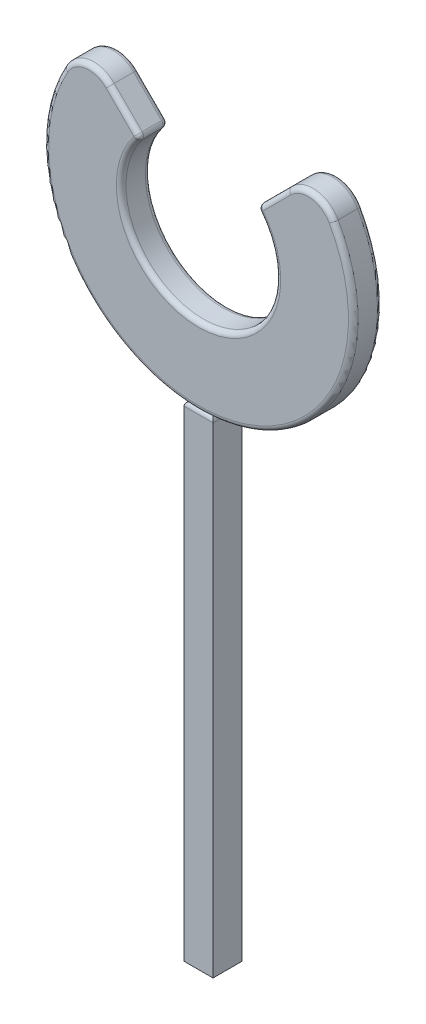
ISO-10303-21;
HEADER;
FILE_DESCRIPTION(('STEP AP214'),'2;1');
FILE_NAME('part.step','',(''),(''),'','','');
FILE_SCHEMA(('AUTOMOTIVE_DESIGN { 1 0 10303 214 1 1 1 1 }'));
ENDSEC;
DATA;
#1=APPLICATION_CONTEXT('core data for automotive mechanical design processes');
#2=APPLICATION_PROTOCOL_DEFINITION('international standard','automotive_design',2000,#1);
#3=PRODUCT_CONTEXT('',#1,'mechanical');
#4=PRODUCT('Part','Part','',(#3));
#5=PRODUCT_RELATED_PRODUCT_CATEGORY('part','',(#4));
#6=PRODUCT_DEFINITION_FORMATION('','',#4);
#7=PRODUCT_DEFINITION_CONTEXT('part definition',#1,'design');
#8=PRODUCT_DEFINITION('design','',#6,#7);
#9=PRODUCT_DEFINITION_SHAPE('','',#8);
#10=(LENGTH_UNIT() NAMED_UNIT(*) SI_UNIT(.MILLI.,.METRE.));
#11=(NAMED_UNIT(*) PLANE_ANGLE_UNIT() SI_UNIT($,.RADIAN.));
#12=(NAMED_UNIT(*) SI_UNIT($,.STERADIAN.) SOLID_ANGLE_UNIT());
#13=UNCERTAINTY_MEASURE_WITH_UNIT(LENGTH_MEASURE(1.E-05),#10,'distance_accuracy_value','');
#14=(GEOMETRIC_REPRESENTATION_CONTEXT(3) GLOBAL_UNCERTAINTY_ASSIGNED_CONTEXT((#13)) GLOBAL_UNIT_ASSIGNED_CONTEXT((#10,
#11,#12)) REPRESENTATION_CONTEXT('',''));
#15=CARTESIAN_POINT('',(0.,0.,0.));
#16=DIRECTION('',(0.,0.,1.));
#17=DIRECTION('',(1.,0.,0.));
#18=AXIS2_PLACEMENT_3D('',#15,#16,#17);
#19=CARTESIAN_POINT('',(-1.5,-15.8,3.));
#20=DIRECTION('',(-1.,0.,0.));
#21=DIRECTION('',(0.,0.,1.));
#22=AXIS2_PLACEMENT_3D('',#19,#20,#21);
#23=PLANE('',#22);
#24=DIRECTION('',(0.,-1.,0.));
#25=VECTOR('',#24,1.);
#26=CARTESIAN_POINT('',(-1.5,-15.8,3.));
#27=LINE('',#26,#25);
#28=CARTESIAN_POINT('',(-1.5,-16.3,3.));
#29=VERTEX_POINT('',#28);
#30=CARTESIAN_POINT('',(-1.5,-66.,3.));
#31=VERTEX_POINT('',#30);
#32=EDGE_CURVE('E131',#29,#31,#27,.T.);
#33=ORIENTED_EDGE('',*,*,#32,.F.);
#34=DIRECTION('',(0.,0.,-1.));
#35=VECTOR('',#34,1.);
#36=CARTESIAN_POINT('',(-1.5,-16.3,0.));
#37=LINE('',#36,#35);
#38=CARTESIAN_POINT('',(-1.5,-16.3,0.));
#39=VERTEX_POINT('',#38);
#40=EDGE_CURVE('E12',#29,#39,#37,.T.);
#41=ORIENTED_EDGE('',*,*,#40,.T.);
#42=DIRECTION('',(0.,-1.,0.));
#43=VECTOR('',#42,1.);
#44=CARTESIAN_POINT('',(-1.5,-15.8,0.));
#45=LINE('',#44,#43);
#46=CARTESIAN_POINT('',(-1.5,-66.,0.));
#47=VERTEX_POINT('',#46);
#48=EDGE_CURVE('E103',#39,#47,#45,.T.);
#49=ORIENTED_EDGE('',*,*,#48,.T.);
#50=DIRECTION('',(0.,0.,-1.));
#51=VECTOR('',#50,1.);
#52=CARTESIAN_POINT('',(-1.5,-66.,3.));
#53=LINE('',#52,#51);
#54=EDGE_CURVE('E106',#31,#47,#53,.T.);
#55=ORIENTED_EDGE('',*,*,#54,.F.);
#56=EDGE_LOOP('',(#33,#41,#49,#55));
#57=FACE_BOUND('',#56,.T.);
#58=ADVANCED_FACE('F49',(#57),#23,.T.);
#59=CARTESIAN_POINT('',(-1.5,-15.8,3.));
#60=DIRECTION('',(0.,0.,1.));
#61=DIRECTION('',(1.,0.,0.));
#62=AXIS2_PLACEMENT_3D('',#59,#60,#61);
#63=PLANE('',#62);
#64=DIRECTION('',(0.,-1.,0.));
#65=VECTOR('',#64,1.);
#66=CARTESIAN_POINT('',(1.5,-15.8,3.));
#67=LINE('',#66,#65);
#68=CARTESIAN_POINT('',(1.5,-16.3,3.));
#69=VERTEX_POINT('',#68);
#70=CARTESIAN_POINT('',(1.5,-66.,3.));
#71=VERTEX_POINT('',#70);
#72=EDGE_CURVE('E134',#69,#71,#67,.T.);
#73=ORIENTED_EDGE('',*,*,#72,.F.);
#74=DIRECTION('',(-1.,0.,0.));
#75=VECTOR('',#74,1.);
#76=CARTESIAN_POINT('',(-1.5,-16.3,3.));
#77=LINE('',#76,#75);
#78=EDGE_CURVE('E58',#69,#29,#77,.T.);
#79=ORIENTED_EDGE('',*,*,#78,.T.);
#80=ORIENTED_EDGE('',*,*,#32,.T.);
#81=DIRECTION('',(-1.,0.,0.));
#82=VECTOR('',#81,1.);
#83=CARTESIAN_POINT('',(-1.5,-66.,3.));
#84=LINE('',#83,#82);
#85=EDGE_CURVE('E112',#71,#31,#84,.T.);
#86=ORIENTED_EDGE('',*,*,#85,.F.);
#87=EDGE_LOOP('',(#73,#79,#80,#86));
#88=FACE_BOUND('',#87,.T.);
#89=ADVANCED_FACE('F169',(#88),#63,.T.);
#90=CARTESIAN_POINT('',(1.5,-15.8,3.));
#91=DIRECTION('',(1.,0.,0.));
#92=DIRECTION('',(0.,0.,-1.));
#93=AXIS2_PLACEMENT_3D('',#90,#91,#92);
#94=PLANE('',#93);
#95=DIRECTION('',(0.,-1.,0.));
#96=VECTOR('',#95,1.);
#97=CARTESIAN_POINT('',(1.5,-15.8,0.));
#98=LINE('',#97,#96);
#99=CARTESIAN_POINT('',(1.5,-16.3,0.));
#100=VERTEX_POINT('',#99);
#101=CARTESIAN_POINT('',(1.5,-66.,0.));
#102=VERTEX_POINT('',#101);
#103=EDGE_CURVE('E111',#100,#102,#98,.T.);
#104=ORIENTED_EDGE('',*,*,#103,.F.);
#105=DIRECTION('',(0.,0.,1.));
#106=VECTOR('',#105,1.);
#107=CARTESIAN_POINT('',(1.5,-16.3,3.));
#108=LINE('',#107,#106);
#109=EDGE_CURVE('E73',#100,#69,#108,.T.);
#110=ORIENTED_EDGE('',*,*,#109,.T.);
#111=ORIENTED_EDGE('',*,*,#72,.T.);
#112=DIRECTION('',(0.,0.,1.));
#113=VECTOR('',#112,1.);
#114=CARTESIAN_POINT('',(1.5,-66.,3.));
#115=LINE('',#114,#113);
#116=EDGE_CURVE('E120',#102,#71,#115,.T.);
#117=ORIENTED_EDGE('',*,*,#116,.F.);
#118=EDGE_LOOP('',(#104,#110,#111,#117));
#119=FACE_BOUND('',#118,.T.);
#120=ADVANCED_FACE('F168',(#119),#94,.T.);
#121=CARTESIAN_POINT('',(-1.5,-15.8,0.));
#122=DIRECTION('',(0.,0.,-1.));
#123=DIRECTION('',(-1.,0.,0.));
#124=AXIS2_PLACEMENT_3D('',#121,#122,#123);
#125=PLANE('',#124);
#126=ORIENTED_EDGE('',*,*,#48,.F.);
#127=DIRECTION('',(1.,0.,0.));
#128=VECTOR('',#127,1.);
#129=CARTESIAN_POINT('',(1.5,-16.3,0.));
#130=LINE('',#129,#128);
#131=EDGE_CURVE('E133',#39,#100,#130,.T.);
#132=ORIENTED_EDGE('',*,*,#131,.T.);
#133=ORIENTED_EDGE('',*,*,#103,.T.);
#134=DIRECTION('',(1.,0.,0.));
#135=VECTOR('',#134,1.);
#136=CARTESIAN_POINT('',(-1.5,-66.,0.));
#137=LINE('',#136,#135);
#138=EDGE_CURVE('E115',#47,#102,#137,.T.);
#139=ORIENTED_EDGE('',*,*,#138,.F.);
#140=EDGE_LOOP('',(#126,#132,#133,#139));
#141=FACE_BOUND('',#140,.T.);
#142=ADVANCED_FACE('F116',(#141),#125,.T.);
#143=CARTESIAN_POINT('',(0.,-15.8,0.));
#144=DIRECTION('',(0.,-1.,0.));
#145=DIRECTION('',(0.,0.,-1.));
#146=AXIS2_PLACEMENT_3D('',#143,#144,#145);
#147=PLANE('',#146);
#148=DIRECTION('',(0.,0.,1.));
#149=VECTOR('',#148,1.);
#150=CARTESIAN_POINT('',(1.,-15.8,0.));
#151=LINE('',#150,#149);
#152=CARTESIAN_POINT('',(0.999999999999999,-15.8,2.5));
#153=VERTEX_POINT('',#152);
#154=CARTESIAN_POINT('',(1.,-15.8,0.5));
#155=VERTEX_POINT('',#154);
#156=EDGE_CURVE('E142',#153,#155,#151,.F.);
#157=ORIENTED_EDGE('',*,*,#156,.T.);
#158=DIRECTION('',(1.,0.,0.));
#159=VECTOR('',#158,1.);
#160=CARTESIAN_POINT('',(-1.5,-15.8,0.499999999999999));
#161=LINE('',#160,#159);
#162=CARTESIAN_POINT('',(-1.,-15.8,0.499999999999999));
#163=VERTEX_POINT('',#162);
#164=EDGE_CURVE('E144',#155,#163,#161,.F.);
#165=ORIENTED_EDGE('',*,*,#164,.T.);
#166=DIRECTION('',(0.,0.,-1.));
#167=VECTOR('',#166,1.);
#168=CARTESIAN_POINT('',(-1.,-15.8,3.));
#169=LINE('',#168,#167);
#170=CARTESIAN_POINT('',(-1.,-15.8,2.5));
#171=VERTEX_POINT('',#170);
#172=EDGE_CURVE('E138',#163,#171,#169,.F.);
#173=ORIENTED_EDGE('',*,*,#172,.T.);
#174=DIRECTION('',(-1.,0.,0.));
#175=VECTOR('',#174,1.);
#176=CARTESIAN_POINT('',(1.5,-15.8,2.5));
#177=LINE('',#176,#175);
#178=EDGE_CURVE('E140',#171,#153,#177,.F.);
#179=ORIENTED_EDGE('',*,*,#178,.T.);
#180=EDGE_LOOP('',(#157,#165,#173,#179));
#181=FACE_BOUND('',#180,.T.);
#182=ADVANCED_FACE('F179',(#181),#147,.F.);
#183=CARTESIAN_POINT('',(0.,-66.,0.));
#184=DIRECTION('',(0.,-1.,0.));
#185=DIRECTION('',(0.,0.,-1.));
#186=AXIS2_PLACEMENT_3D('',#183,#184,#185);
#187=PLANE('',#186);
#188=ORIENTED_EDGE('',*,*,#54,.T.);
#189=ORIENTED_EDGE('',*,*,#138,.T.);
#190=ORIENTED_EDGE('',*,*,#116,.T.);
#191=ORIENTED_EDGE('',*,*,#85,.T.);
#192=EDGE_LOOP('',(#188,#189,#190,#191));
#193=FACE_BOUND('',#192,.T.);
#194=ADVANCED_FACE('F123',(#193),#187,.T.);
#195=CARTESIAN_POINT('',(-1.5,-16.3,2.5));
#196=DIRECTION('',(1.,0.,0.));
#197=DIRECTION('',(0.,0.,-1.));
#198=AXIS2_PLACEMENT_3D('',#195,#196,#197);
#199=CYLINDRICAL_SURFACE('',#198,0.5);
#200=CARTESIAN_POINT('',(0.999999999999999,-16.3,2.5));
#201=DIRECTION('',(0.707106781186548,0.,-0.707106781186547));
#202=DIRECTION('',(0.707106781186547,0.,0.707106781186548));
#203=AXIS2_PLACEMENT_3D('',#200,#201,#202);
#204=ELLIPSE('',#203,0.707106781186547,0.5);
#205=EDGE_CURVE('E127',#153,#69,#204,.T.);
#206=ORIENTED_EDGE('',*,*,#205,.F.);
#207=ORIENTED_EDGE('',*,*,#178,.F.);
#208=CARTESIAN_POINT('',(-1.,-16.3,2.5));
#209=DIRECTION('',(0.707106781186548,0.,0.707106781186547));
#210=DIRECTION('',(-0.707106781186548,0.,0.707106781186548));
#211=AXIS2_PLACEMENT_3D('',#208,#209,#210);
#212=ELLIPSE('',#211,0.707106781186547,0.5);
#213=EDGE_CURVE('E53',#29,#171,#212,.F.);
#214=ORIENTED_EDGE('',*,*,#213,.F.);
#215=ORIENTED_EDGE('',*,*,#78,.F.);
#216=EDGE_LOOP('',(#206,#207,#214,#215));
#217=FACE_BOUND('',#216,.T.);
#218=ADVANCED_FACE('F51',(#217),#199,.T.);
#219=CARTESIAN_POINT('',(-1.,-16.3,3.));
#220=DIRECTION('',(0.,0.,1.));
#221=DIRECTION('',(1.,0.,0.));
#222=AXIS2_PLACEMENT_3D('',#219,#220,#221);
#223=CYLINDRICAL_SURFACE('',#222,0.5);
#224=ORIENTED_EDGE('',*,*,#213,.T.);
#225=ORIENTED_EDGE('',*,*,#172,.F.);
#226=CARTESIAN_POINT('',(-1.,-16.3,0.499999999999999));
#227=DIRECTION('',(-0.707106781186548,0.,0.707106781186548));
#228=DIRECTION('',(0.707106781186548,0.,0.707106781186547));
#229=AXIS2_PLACEMENT_3D('',#226,#227,#228);
#230=ELLIPSE('',#229,0.707106781186548,0.5);
#231=EDGE_CURVE('E151',#39,#163,#230,.F.);
#232=ORIENTED_EDGE('',*,*,#231,.F.);
#233=ORIENTED_EDGE('',*,*,#40,.F.);
#234=EDGE_LOOP('',(#224,#225,#232,#233));
#235=FACE_BOUND('',#234,.T.);
#236=ADVANCED_FACE('F163',(#235),#223,.T.);
#237=CARTESIAN_POINT('',(0.999999999999999,-16.3,3.));
#238=DIRECTION('',(0.,0.,-1.));
#239=DIRECTION('',(-1.,0.,0.));
#240=AXIS2_PLACEMENT_3D('',#237,#238,#239);
#241=CYLINDRICAL_SURFACE('',#240,0.5);
#242=ORIENTED_EDGE('',*,*,#205,.T.);
#243=ORIENTED_EDGE('',*,*,#109,.F.);
#244=CARTESIAN_POINT('',(1.,-16.3,0.5));
#245=DIRECTION('',(-0.707106781186547,0.,-0.707106781186548));
#246=DIRECTION('',(0.707106781186548,0.,-0.707106781186547));
#247=AXIS2_PLACEMENT_3D('',#244,#245,#246);
#248=ELLIPSE('',#247,0.707106781186548,0.5);
#249=EDGE_CURVE('E149',#155,#100,#248,.T.);
#250=ORIENTED_EDGE('',*,*,#249,.F.);
#251=ORIENTED_EDGE('',*,*,#156,.F.);
#252=EDGE_LOOP('',(#242,#243,#250,#251));
#253=FACE_BOUND('',#252,.T.);
#254=ADVANCED_FACE('F156',(#253),#241,.T.);
#255=CARTESIAN_POINT('',(-1.5,-16.3,0.499999999999999));
#256=DIRECTION('',(-1.,0.,0.));
#257=DIRECTION('',(0.,0.,1.));
#258=AXIS2_PLACEMENT_3D('',#255,#256,#257);
#259=CYLINDRICAL_SURFACE('',#258,0.5);
#260=ORIENTED_EDGE('',*,*,#231,.T.);
#261=ORIENTED_EDGE('',*,*,#164,.F.);
#262=ORIENTED_EDGE('',*,*,#249,.T.);
#263=ORIENTED_EDGE('',*,*,#131,.F.);
#264=EDGE_LOOP('',(#260,#261,#262,#263));
#265=FACE_BOUND('',#264,.T.);
#266=ADVANCED_FACE('F167',(#265),#259,.T.);
#267=CLOSED_SHELL('',(#58,#89,#120,#142,#182,#194,#218,#236,#254,#266));
#268=MANIFOLD_SOLID_BREP('B2',#267);
#269=CARTESIAN_POINT('',(0.,0.,3.));
#270=DIRECTION('',(0.,0.,1.));
#271=DIRECTION('',(1.,0.,0.));
#272=AXIS2_PLACEMENT_3D('',#269,#270,#271);
#273=PLANE('',#272);
#274=DIRECTION('',(0.707106781186546,0.707106781186549,0.));
#275=VECTOR('',#274,1.);
#276=CARTESIAN_POINT('',(6.35355339059327,4.93794923153591,3.));
#277=LINE('',#276,#275);
#278=CARTESIAN_POINT('',(9.56057328211555,8.1449691230582,3.));
#279=VERTEX_POINT('',#278);
#280=CARTESIAN_POINT('',(6.67638785977972,5.26078370072235,3.));
#281=VERTEX_POINT('',#280);
#282=EDGE_CURVE('E393',#279,#281,#277,.F.);
#283=ORIENTED_EDGE('',*,*,#282,.T.);
#284=CARTESIAN_POINT('',(0.,0.,3.));
#285=DIRECTION('',(0.,0.,1.));
#286=DIRECTION('',(1.,0.,0.));
#287=AXIS2_PLACEMENT_3D('',#284,#285,#286);
#288=CIRCLE('',#287,8.5);
#289=CARTESIAN_POINT('',(-6.67638785977972,5.26078370072235,3.));
#290=VERTEX_POINT('',#289);
#291=EDGE_CURVE('E503',#281,#290,#288,.F.);
#292=ORIENTED_EDGE('',*,*,#291,.T.);
#293=DIRECTION('',(0.707106781186546,-0.707106781186549,0.));
#294=VECTOR('',#293,1.);
#295=CARTESIAN_POINT('',(-9.56057328211556,8.14496912305821,3.));
#296=LINE('',#295,#294);
#297=CARTESIAN_POINT('',(-9.56057328211555,8.1449691230582,3.));
#298=VERTEX_POINT('',#297);
#299=EDGE_CURVE('E489',#290,#298,#296,.F.);
#300=ORIENTED_EDGE('',*,*,#299,.T.);
#301=CARTESIAN_POINT('',(-11.3283402350819,6.37720217009184,3.));
#302=DIRECTION('',(0.,0.,1.));
#303=DIRECTION('',(1.,0.,0.));
#304=AXIS2_PLACEMENT_3D('',#301,#302,#303);
#305=CIRCLE('',#304,2.5);
#306=CARTESIAN_POINT('',(-13.5068672033669,7.6035872028018,3.));
#307=VERTEX_POINT('',#306);
#308=EDGE_CURVE('E492',#298,#307,#305,.T.);
#309=ORIENTED_EDGE('',*,*,#308,.T.);
#310=CARTESIAN_POINT('',(0.,0.,3.));
#311=DIRECTION('',(0.,0.,1.));
#312=DIRECTION('',(1.,0.,0.));
#313=AXIS2_PLACEMENT_3D('',#310,#311,#312);
#314=CIRCLE('',#313,15.5);
#315=CARTESIAN_POINT('',(13.5068672033669,7.6035872028018,3.));
#316=VERTEX_POINT('',#315);
#317=EDGE_CURVE('E495',#307,#316,#314,.T.);
#318=ORIENTED_EDGE('',*,*,#317,.T.);
#319=CARTESIAN_POINT('',(11.3283402350819,6.37720217009184,3.));
#320=DIRECTION('',(0.,0.,1.));
#321=DIRECTION('',(1.,0.,0.));
#322=AXIS2_PLACEMENT_3D('',#319,#320,#321);
#323=CIRCLE('',#322,2.5);
#324=EDGE_CURVE('E498',#316,#279,#323,.T.);
#325=ORIENTED_EDGE('',*,*,#324,.T.);
#326=EDGE_LOOP('',(#283,#292,#300,#309,#318,#325));
#327=FACE_BOUND('',#326,.T.);
#328=ADVANCED_FACE('F253',(#327),#273,.T.);
#329=CARTESIAN_POINT('',(0.,0.,0.));
#330=DIRECTION('',(0.,0.,1.));
#331=DIRECTION('',(1.,0.,0.));
#332=AXIS2_PLACEMENT_3D('',#329,#330,#331);
#333=PLANE('',#332);
#334=DIRECTION('',(0.707106781186546,0.707106781186549,0.));
#335=VECTOR('',#334,1.);
#336=CARTESIAN_POINT('',(0.707802079528696,-0.707802079528693,0.));
#337=LINE('',#336,#335);
#338=CARTESIAN_POINT('',(6.67638785977972,5.26078370072235,0.));
#339=VERTEX_POINT('',#338);
#340=CARTESIAN_POINT('',(9.56057328211555,8.1449691230582,0.));
#341=VERTEX_POINT('',#340);
#342=EDGE_CURVE('E263',#339,#341,#337,.T.);
#343=ORIENTED_EDGE('',*,*,#342,.T.);
#344=CARTESIAN_POINT('',(11.3283402350819,6.37720217009184,0.));
#345=DIRECTION('',(0.,0.,1.));
#346=DIRECTION('',(1.,0.,0.));
#347=AXIS2_PLACEMENT_3D('',#344,#345,#346);
#348=CIRCLE('',#347,2.5);
#349=CARTESIAN_POINT('',(13.5068672033669,7.6035872028018,0.));
#350=VERTEX_POINT('',#349);
#351=EDGE_CURVE('E47',#341,#350,#348,.F.);
#352=ORIENTED_EDGE('',*,*,#351,.T.);
#353=CARTESIAN_POINT('',(0.,0.,0.));
#354=DIRECTION('',(0.,0.,1.));
#355=DIRECTION('',(1.,0.,0.));
#356=AXIS2_PLACEMENT_3D('',#353,#354,#355);
#357=CIRCLE('',#356,15.5);
#358=CARTESIAN_POINT('',(-13.5068672033669,7.6035872028018,0.));
#359=VERTEX_POINT('',#358);
#360=EDGE_CURVE('E520',#350,#359,#357,.F.);
#361=ORIENTED_EDGE('',*,*,#360,.T.);
#362=CARTESIAN_POINT('',(-11.3283402350819,6.37720217009184,0.));
#363=DIRECTION('',(0.,0.,1.));
#364=DIRECTION('',(1.,0.,0.));
#365=AXIS2_PLACEMENT_3D('',#362,#363,#364);
#366=CIRCLE('',#365,2.5);
#367=CARTESIAN_POINT('',(-9.56057328211555,8.1449691230582,0.));
#368=VERTEX_POINT('',#367);
#369=EDGE_CURVE('E523',#359,#368,#366,.F.);
#370=ORIENTED_EDGE('',*,*,#369,.T.);
#371=DIRECTION('',(0.707106781186546,-0.707106781186549,0.));
#372=VECTOR('',#371,1.);
#373=CARTESIAN_POINT('',(-0.707802079528696,-0.707802079528693,0.));
#374=LINE('',#373,#372);
#375=CARTESIAN_POINT('',(-6.67638785977972,5.26078370072235,0.));
#376=VERTEX_POINT('',#375);
#377=EDGE_CURVE('E526',#368,#376,#374,.T.);
#378=ORIENTED_EDGE('',*,*,#377,.T.);
#379=CARTESIAN_POINT('',(0.,0.,0.));
#380=DIRECTION('',(0.,0.,1.));
#381=DIRECTION('',(1.,0.,0.));
#382=AXIS2_PLACEMENT_3D('',#379,#380,#381);
#383=CIRCLE('',#382,8.5);
#384=EDGE_CURVE('E274',#376,#339,#383,.T.);
#385=ORIENTED_EDGE('',*,*,#384,.T.);
#386=EDGE_LOOP('',(#343,#352,#361,#370,#378,#385));
#387=FACE_BOUND('',#386,.T.);
#388=ADVANCED_FACE('F627',(#387),#333,.F.);
#389=CARTESIAN_POINT('',(0.,0.,3.));
#390=DIRECTION('',(0.,0.,-1.));
#391=DIRECTION('',(-1.,0.,0.));
#392=AXIS2_PLACEMENT_3D('',#389,#390,#391);
#393=CYLINDRICAL_SURFACE('',#392,16.);
#394=DIRECTION('',(0.,0.,-1.));
#395=VECTOR('',#394,1.);
#396=CARTESIAN_POINT('',(13.9425725970239,7.8488642093438,3.));
#397=LINE('',#396,#395);
#398=CARTESIAN_POINT('',(13.9425725970239,7.8488642093438,0.5));
#399=VERTEX_POINT('',#398);
#400=CARTESIAN_POINT('',(13.9425725970239,7.8488642093438,2.5));
#401=VERTEX_POINT('',#400);
#402=EDGE_CURVE('E447',#399,#401,#397,.F.);
#403=ORIENTED_EDGE('',*,*,#402,.T.);
#404=CARTESIAN_POINT('',(0.,0.,2.5));
#405=DIRECTION('',(0.,0.,1.));
#406=DIRECTION('',(1.,0.,0.));
#407=AXIS2_PLACEMENT_3D('',#404,#405,#406);
#408=CIRCLE('',#407,16.);
#409=CARTESIAN_POINT('',(-13.9425725970239,7.8488642093438,2.5));
#410=VERTEX_POINT('',#409);
#411=EDGE_CURVE('E511',#401,#410,#408,.F.);
#412=ORIENTED_EDGE('',*,*,#411,.T.);
#413=DIRECTION('',(0.,0.,-1.));
#414=VECTOR('',#413,1.);
#415=CARTESIAN_POINT('',(-13.9425725970239,7.8488642093438,3.));
#416=LINE('',#415,#414);
#417=CARTESIAN_POINT('',(-13.9425725970239,7.8488642093438,0.5));
#418=VERTEX_POINT('',#417);
#419=EDGE_CURVE('E453',#410,#418,#416,.T.);
#420=ORIENTED_EDGE('',*,*,#419,.T.);
#421=CARTESIAN_POINT('',(0.,0.,0.5));
#422=DIRECTION('',(0.,0.,1.));
#423=DIRECTION('',(1.,0.,0.));
#424=AXIS2_PLACEMENT_3D('',#421,#422,#423);
#425=CIRCLE('',#424,16.);
#426=EDGE_CURVE('E390',#418,#399,#425,.T.);
#427=ORIENTED_EDGE('',*,*,#426,.T.);
#428=EDGE_LOOP('',(#403,#412,#420,#427));
#429=FACE_BOUND('',#428,.T.);
#430=ADVANCED_FACE('F584',(#429),#393,.T.);
#431=CARTESIAN_POINT('',(0.,0.,3.));
#432=DIRECTION('',(0.,0.,-1.));
#433=DIRECTION('',(-1.,0.,0.));
#434=AXIS2_PLACEMENT_3D('',#431,#432,#433);
#435=CYLINDRICAL_SURFACE('',#434,8.);
#436=DIRECTION('',(0.,0.,-1.));
#437=VECTOR('',#436,1.);
#438=CARTESIAN_POINT('',(-6.28365916214562,4.95132583597398,3.));
#439=LINE('',#438,#437);
#440=CARTESIAN_POINT('',(-6.28365916214562,4.95132583597398,0.5));
#441=VERTEX_POINT('',#440);
#442=CARTESIAN_POINT('',(-6.28365916214562,4.95132583597398,2.5));
#443=VERTEX_POINT('',#442);
#444=EDGE_CURVE('E470',#441,#443,#439,.F.);
#445=ORIENTED_EDGE('',*,*,#444,.T.);
#446=CARTESIAN_POINT('',(0.,0.,2.5));
#447=DIRECTION('',(0.,0.,1.));
#448=DIRECTION('',(1.,0.,0.));
#449=AXIS2_PLACEMENT_3D('',#446,#447,#448);
#450=CIRCLE('',#449,8.);
#451=CARTESIAN_POINT('',(6.28365916214562,4.95132583597398,2.5));
#452=VERTEX_POINT('',#451);
#453=EDGE_CURVE('E477',#443,#452,#450,.T.);
#454=ORIENTED_EDGE('',*,*,#453,.T.);
#455=DIRECTION('',(0.,0.,-1.));
#456=VECTOR('',#455,1.);
#457=CARTESIAN_POINT('',(6.28365916214562,4.95132583597398,3.));
#458=LINE('',#457,#456);
#459=CARTESIAN_POINT('',(6.28365916214562,4.95132583597398,0.5));
#460=VERTEX_POINT('',#459);
#461=EDGE_CURVE('E473',#452,#460,#458,.T.);
#462=ORIENTED_EDGE('',*,*,#461,.T.);
#463=CARTESIAN_POINT('',(0.,0.,0.5));
#464=DIRECTION('',(0.,0.,1.));
#465=DIRECTION('',(1.,0.,0.));
#466=AXIS2_PLACEMENT_3D('',#463,#464,#465);
#467=CIRCLE('',#466,8.);
#468=EDGE_CURVE('E366',#460,#441,#467,.F.);
#469=ORIENTED_EDGE('',*,*,#468,.T.);
#470=EDGE_LOOP('',(#445,#454,#462,#469));
#471=FACE_BOUND('',#470,.T.);
#472=ADVANCED_FACE('F564',(#471),#435,.F.);
#473=CARTESIAN_POINT('',(6.,5.29150262212918,0.));
#474=DIRECTION('',(0.707106781186549,-0.707106781186546,0.));
#475=DIRECTION('',(0.707106781186546,0.707106781186549,0.));
#476=AXIS2_PLACEMENT_3D('',#473,#474,#475);
#477=PLANE('',#476);
#478=DIRECTION('',(0.,0.,1.));
#479=VECTOR('',#478,1.);
#480=CARTESIAN_POINT('',(6.32283446918644,5.61433709131563,3.));
#481=LINE('',#480,#479);
#482=CARTESIAN_POINT('',(6.32283446918644,5.61433709131563,0.5));
#483=VERTEX_POINT('',#482);
#484=CARTESIAN_POINT('',(6.32283446918644,5.61433709131563,2.5));
#485=VERTEX_POINT('',#484);
#486=EDGE_CURVE('E361',#483,#485,#481,.T.);
#487=ORIENTED_EDGE('',*,*,#486,.T.);
#488=DIRECTION('',(0.707106781186546,0.707106781186549,0.));
#489=VECTOR('',#488,1.);
#490=CARTESIAN_POINT('',(9.20701989152228,8.49852251365147,2.5));
#491=LINE('',#490,#489);
#492=CARTESIAN_POINT('',(9.20701989152228,8.49852251365147,2.5));
#493=VERTEX_POINT('',#492);
#494=EDGE_CURVE('E355',#485,#493,#491,.T.);
#495=ORIENTED_EDGE('',*,*,#494,.T.);
#496=DIRECTION('',(0.,0.,-1.));
#497=VECTOR('',#496,1.);
#498=CARTESIAN_POINT('',(9.20701989152228,8.49852251365147,0.));
#499=LINE('',#498,#497);
#500=CARTESIAN_POINT('',(9.20701989152228,8.49852251365147,0.5));
#501=VERTEX_POINT('',#500);
#502=EDGE_CURVE('E358',#493,#501,#499,.T.);
#503=ORIENTED_EDGE('',*,*,#502,.T.);
#504=DIRECTION('',(0.707106781186546,0.707106781186549,0.));
#505=VECTOR('',#504,1.);
#506=CARTESIAN_POINT('',(6.,5.29150262212918,0.5));
#507=LINE('',#506,#505);
#508=EDGE_CURVE('E377',#501,#483,#507,.F.);
#509=ORIENTED_EDGE('',*,*,#508,.T.);
#510=EDGE_LOOP('',(#487,#495,#503,#509));
#511=FACE_BOUND('',#510,.T.);
#512=ADVANCED_FACE('F357',(#511),#477,.F.);
#513=CARTESIAN_POINT('',(-18.,17.2915026221292,0.));
#514=DIRECTION('',(-0.707106781186549,-0.707106781186546,0.));
#515=DIRECTION('',(0.707106781186546,-0.707106781186549,0.));
#516=AXIS2_PLACEMENT_3D('',#513,#514,#515);
#517=PLANE('',#516);
#518=DIRECTION('',(0.,0.,-1.));
#519=VECTOR('',#518,1.);
#520=CARTESIAN_POINT('',(-9.20701989152228,8.49852251365147,0.));
#521=LINE('',#520,#519);
#522=CARTESIAN_POINT('',(-9.20701989152228,8.49852251365147,0.5));
#523=VERTEX_POINT('',#522);
#524=CARTESIAN_POINT('',(-9.20701989152228,8.49852251365147,2.5));
#525=VERTEX_POINT('',#524);
#526=EDGE_CURVE('E378',#523,#525,#521,.F.);
#527=ORIENTED_EDGE('',*,*,#526,.T.);
#528=DIRECTION('',(0.707106781186546,-0.707106781186549,0.));
#529=VECTOR('',#528,1.);
#530=CARTESIAN_POINT('',(-6.,5.29150262212918,2.5));
#531=LINE('',#530,#529);
#532=CARTESIAN_POINT('',(-6.32283446918645,5.61433709131563,2.5));
#533=VERTEX_POINT('',#532);
#534=EDGE_CURVE('E486',#525,#533,#531,.T.);
#535=ORIENTED_EDGE('',*,*,#534,.T.);
#536=DIRECTION('',(0.,0.,1.));
#537=VECTOR('',#536,1.);
#538=CARTESIAN_POINT('',(-6.32283446918644,5.61433709131563,0.));
#539=LINE('',#538,#537);
#540=CARTESIAN_POINT('',(-6.32283446918645,5.61433709131563,0.5));
#541=VERTEX_POINT('',#540);
#542=EDGE_CURVE('E483',#533,#541,#539,.F.);
#543=ORIENTED_EDGE('',*,*,#542,.T.);
#544=DIRECTION('',(0.707106781186546,-0.707106781186549,0.));
#545=VECTOR('',#544,1.);
#546=CARTESIAN_POINT('',(-18.,17.2915026221292,0.5));
#547=LINE('',#546,#545);
#548=EDGE_CURVE('E480',#541,#523,#547,.F.);
#549=ORIENTED_EDGE('',*,*,#548,.T.);
#550=EDGE_LOOP('',(#527,#535,#543,#549));
#551=FACE_BOUND('',#550,.T.);
#552=ADVANCED_FACE('F599',(#551),#517,.F.);
#553=CARTESIAN_POINT('',(-11.3283402350819,6.37720217009184,3.));
#554=DIRECTION('',(0.,0.,-1.));
#555=DIRECTION('',(-1.,0.,0.));
#556=AXIS2_PLACEMENT_3D('',#553,#554,#555);
#557=CYLINDRICAL_SURFACE('',#556,3.);
#558=ORIENTED_EDGE('',*,*,#419,.F.);
#559=CARTESIAN_POINT('',(-11.3283402350819,6.37720217009184,2.5));
#560=DIRECTION('',(0.,0.,1.));
#561=DIRECTION('',(1.,0.,0.));
#562=AXIS2_PLACEMENT_3D('',#559,#560,#561);
#563=CIRCLE('',#562,3.);
#564=EDGE_CURVE('E517',#410,#525,#563,.F.);
#565=ORIENTED_EDGE('',*,*,#564,.T.);
#566=ORIENTED_EDGE('',*,*,#526,.F.);
#567=CARTESIAN_POINT('',(-11.3283402350819,6.37720217009184,0.5));
#568=DIRECTION('',(0.,0.,1.));
#569=DIRECTION('',(1.,0.,0.));
#570=AXIS2_PLACEMENT_3D('',#567,#568,#569);
#571=CIRCLE('',#570,3.);
#572=EDGE_CURVE('E514',#523,#418,#571,.T.);
#573=ORIENTED_EDGE('',*,*,#572,.T.);
#574=EDGE_LOOP('',(#558,#565,#566,#573));
#575=FACE_BOUND('',#574,.T.);
#576=ADVANCED_FACE('F587',(#575),#557,.T.);
#577=CARTESIAN_POINT('',(11.3283402350819,6.37720217009184,3.));
#578=DIRECTION('',(0.,0.,-1.));
#579=DIRECTION('',(-1.,0.,0.));
#580=AXIS2_PLACEMENT_3D('',#577,#578,#579);
#581=CYLINDRICAL_SURFACE('',#580,3.);
#582=ORIENTED_EDGE('',*,*,#502,.F.);
#583=CARTESIAN_POINT('',(11.3283402350819,6.37720217009184,2.5));
#584=DIRECTION('',(0.,0.,1.));
#585=DIRECTION('',(1.,0.,0.));
#586=AXIS2_PLACEMENT_3D('',#583,#584,#585);
#587=CIRCLE('',#586,3.);
#588=EDGE_CURVE('E372',#493,#401,#587,.F.);
#589=ORIENTED_EDGE('',*,*,#588,.T.);
#590=ORIENTED_EDGE('',*,*,#402,.F.);
#591=CARTESIAN_POINT('',(11.3283402350819,6.37720217009184,0.5));
#592=DIRECTION('',(0.,0.,1.));
#593=DIRECTION('',(1.,0.,0.));
#594=AXIS2_PLACEMENT_3D('',#591,#592,#593);
#595=CIRCLE('',#594,3.);
#596=EDGE_CURVE('E375',#399,#501,#595,.T.);
#597=ORIENTED_EDGE('',*,*,#596,.T.);
#598=EDGE_LOOP('',(#582,#589,#590,#597));
#599=FACE_BOUND('',#598,.T.);
#600=ADVANCED_FACE('F370',(#599),#581,.T.);
#601=CARTESIAN_POINT('',(-11.3283402350819,6.37720217009184,0.5));
#602=DIRECTION('',(0.,0.,1.));
#603=DIRECTION('',(1.,0.,0.));
#604=AXIS2_PLACEMENT_3D('',#601,#602,#603);
#605=TOROIDAL_SURFACE('',#604,2.5,0.5);
#606=CARTESIAN_POINT('',(-13.5068672033669,7.6035872028018,0.5));
#607=DIRECTION('',(-0.490554013083987,-0.871410787313994,0.));
#608=DIRECTION('',(0.871410787313994,-0.490554013083987,0.));
#609=AXIS2_PLACEMENT_3D('',#606,#607,#608);
#610=CIRCLE('',#609,0.5);
#611=EDGE_CURVE('E438',#418,#359,#610,.T.);
#612=ORIENTED_EDGE('',*,*,#611,.F.);
#613=ORIENTED_EDGE('',*,*,#572,.F.);
#614=CARTESIAN_POINT('',(-9.56057328211555,8.1449691230582,0.5));
#615=DIRECTION('',(0.707106781186546,-0.707106781186549,0.));
#616=DIRECTION('',(0.707106781186549,0.707106781186546,0.));
#617=AXIS2_PLACEMENT_3D('',#614,#615,#616);
#618=CIRCLE('',#617,0.5);
#619=EDGE_CURVE('E257',#368,#523,#618,.T.);
#620=ORIENTED_EDGE('',*,*,#619,.F.);
#621=ORIENTED_EDGE('',*,*,#369,.F.);
#622=EDGE_LOOP('',(#612,#613,#620,#621));
#623=FACE_BOUND('',#622,.T.);
#624=ADVANCED_FACE('F255',(#623),#605,.T.);
#625=CARTESIAN_POINT('',(-11.3283402350819,6.37720217009184,2.5));
#626=DIRECTION('',(0.,0.,1.));
#627=DIRECTION('',(1.,0.,0.));
#628=AXIS2_PLACEMENT_3D('',#625,#626,#627);
#629=TOROIDAL_SURFACE('',#628,2.5,0.5);
#630=CARTESIAN_POINT('',(-9.56057328211555,8.1449691230582,2.5));
#631=DIRECTION('',(0.707106781186546,-0.707106781186549,0.));
#632=DIRECTION('',(0.707106781186549,0.707106781186546,0.));
#633=AXIS2_PLACEMENT_3D('',#630,#631,#632);
#634=CIRCLE('',#633,0.5);
#635=EDGE_CURVE('E431',#525,#298,#634,.T.);
#636=ORIENTED_EDGE('',*,*,#635,.F.);
#637=ORIENTED_EDGE('',*,*,#564,.F.);
#638=CARTESIAN_POINT('',(-13.5068672033669,7.6035872028018,2.5));
#639=DIRECTION('',(-0.490554013083986,-0.871410787313995,0.));
#640=DIRECTION('',(0.871410787313995,-0.490554013083986,0.));
#641=AXIS2_PLACEMENT_3D('',#638,#639,#640);
#642=CIRCLE('',#641,0.5);
#643=EDGE_CURVE('E435',#307,#410,#642,.T.);
#644=ORIENTED_EDGE('',*,*,#643,.F.);
#645=ORIENTED_EDGE('',*,*,#308,.F.);
#646=EDGE_LOOP('',(#636,#637,#644,#645));
#647=FACE_BOUND('',#646,.T.);
#648=ADVANCED_FACE('F592',(#647),#629,.T.);
#649=CARTESIAN_POINT('',(-0.707802079528696,-0.707802079528693,0.5));
#650=DIRECTION('',(0.707106781186546,-0.707106781186549,0.));
#651=DIRECTION('',(0.707106781186549,0.707106781186546,0.));
#652=AXIS2_PLACEMENT_3D('',#649,#650,#651);
#653=CYLINDRICAL_SURFACE('',#652,0.5);
#654=ORIENTED_EDGE('',*,*,#619,.T.);
#655=ORIENTED_EDGE('',*,*,#548,.F.);
#656=CARTESIAN_POINT('',(-6.67638785977972,5.26078370072235,0.5));
#657=DIRECTION('',(0.707106781186547,-0.707106781186548,0.));
#658=DIRECTION('',(0.707106781186548,0.707106781186547,0.));
#659=AXIS2_PLACEMENT_3D('',#656,#657,#658);
#660=CIRCLE('',#659,0.5);
#661=EDGE_CURVE('E423',#376,#541,#660,.T.);
#662=ORIENTED_EDGE('',*,*,#661,.F.);
#663=ORIENTED_EDGE('',*,*,#377,.F.);
#664=EDGE_LOOP('',(#654,#655,#662,#663));
#665=FACE_BOUND('',#664,.T.);
#666=ADVANCED_FACE('F607',(#665),#653,.T.);
#667=CARTESIAN_POINT('',(0.,0.,0.5));
#668=DIRECTION('',(0.,0.,1.));
#669=DIRECTION('',(1.,0.,0.));
#670=AXIS2_PLACEMENT_3D('',#667,#668,#669);
#671=TOROIDAL_SURFACE('',#670,15.5,0.5);
#672=ORIENTED_EDGE('',*,*,#611,.T.);
#673=ORIENTED_EDGE('',*,*,#360,.F.);
#674=CARTESIAN_POINT('',(13.5068672033669,7.6035872028018,0.5));
#675=DIRECTION('',(-0.490554013083987,0.871410787313994,0.));
#676=DIRECTION('',(-0.871410787313994,-0.490554013083987,0.));
#677=AXIS2_PLACEMENT_3D('',#674,#675,#676);
#678=CIRCLE('',#677,0.5);
#679=EDGE_CURVE('E420',#399,#350,#678,.T.);
#680=ORIENTED_EDGE('',*,*,#679,.F.);
#681=ORIENTED_EDGE('',*,*,#426,.F.);
#682=EDGE_LOOP('',(#672,#673,#680,#681));
#683=FACE_BOUND('',#682,.T.);
#684=ADVANCED_FACE('F611',(#683),#671,.T.);
#685=CARTESIAN_POINT('',(0.,0.,2.5));
#686=DIRECTION('',(0.,0.,1.));
#687=DIRECTION('',(1.,0.,0.));
#688=AXIS2_PLACEMENT_3D('',#685,#686,#687);
#689=TOROIDAL_SURFACE('',#688,15.5,0.5);
#690=ORIENTED_EDGE('',*,*,#643,.T.);
#691=ORIENTED_EDGE('',*,*,#411,.F.);
#692=CARTESIAN_POINT('',(13.5068672033669,7.6035872028018,2.5));
#693=DIRECTION('',(-0.490554013083986,0.871410787313995,0.));
#694=DIRECTION('',(-0.871410787313995,-0.490554013083986,0.));
#695=AXIS2_PLACEMENT_3D('',#692,#693,#694);
#696=CIRCLE('',#695,0.5);
#697=EDGE_CURVE('E388',#316,#401,#696,.T.);
#698=ORIENTED_EDGE('',*,*,#697,.F.);
#699=ORIENTED_EDGE('',*,*,#317,.F.);
#700=EDGE_LOOP('',(#690,#691,#698,#699));
#701=FACE_BOUND('',#700,.T.);
#702=ADVANCED_FACE('F582',(#701),#689,.T.);
#703=CARTESIAN_POINT('',(-18.3535533905932,16.9379492315359,2.5));
#704=DIRECTION('',(-0.707106781186546,0.707106781186549,0.));
#705=DIRECTION('',(-0.707106781186549,-0.707106781186546,0.));
#706=AXIS2_PLACEMENT_3D('',#703,#704,#705);
#707=CYLINDRICAL_SURFACE('',#706,0.5);
#708=ORIENTED_EDGE('',*,*,#635,.T.);
#709=ORIENTED_EDGE('',*,*,#299,.F.);
#710=CARTESIAN_POINT('',(-6.67638785977972,5.26078370072235,2.5));
#711=DIRECTION('',(0.707106781186547,-0.707106781186548,0.));
#712=DIRECTION('',(0.707106781186548,0.707106781186547,0.));
#713=AXIS2_PLACEMENT_3D('',#710,#711,#712);
#714=CIRCLE('',#713,0.5);
#715=EDGE_CURVE('E414',#533,#290,#714,.T.);
#716=ORIENTED_EDGE('',*,*,#715,.F.);
#717=ORIENTED_EDGE('',*,*,#534,.F.);
#718=EDGE_LOOP('',(#708,#709,#716,#717));
#719=FACE_BOUND('',#718,.T.);
#720=ADVANCED_FACE('F596',(#719),#707,.T.);
#721=CARTESIAN_POINT('',(-6.67638785977972,5.26078370072235,3.));
#722=DIRECTION('',(0.,0.,-1.));
#723=DIRECTION('',(-1.,0.,0.));
#724=AXIS2_PLACEMENT_3D('',#721,#722,#723);
#725=CYLINDRICAL_SURFACE('',#724,0.5);
#726=CARTESIAN_POINT('',(-6.67638785977972,5.26078370072235,0.5));
#727=DIRECTION('',(0.,0.,-1.));
#728=DIRECTION('',(-1.,0.,0.));
#729=AXIS2_PLACEMENT_3D('',#726,#727,#728);
#730=CIRCLE('',#729,0.5);
#731=EDGE_CURVE('E427',#541,#441,#730,.T.);
#732=ORIENTED_EDGE('',*,*,#731,.F.);
#733=ORIENTED_EDGE('',*,*,#542,.F.);
#734=CARTESIAN_POINT('',(-6.67638785977972,5.26078370072235,2.5));
#735=DIRECTION('',(0.,0.,1.));
#736=DIRECTION('',(1.,0.,0.));
#737=AXIS2_PLACEMENT_3D('',#734,#735,#736);
#738=CIRCLE('',#737,0.5);
#739=EDGE_CURVE('E410',#443,#533,#738,.T.);
#740=ORIENTED_EDGE('',*,*,#739,.F.);
#741=ORIENTED_EDGE('',*,*,#444,.F.);
#742=EDGE_LOOP('',(#732,#733,#740,#741));
#743=FACE_BOUND('',#742,.T.);
#744=ADVANCED_FACE('F603',(#743),#725,.T.);
#745=CARTESIAN_POINT('',(-6.67638785977972,5.26078370072235,0.5));
#746=DIRECTION('',(0.,0.,1.));
#747=DIRECTION('',(1.,0.,0.));
#748=AXIS2_PLACEMENT_3D('',#745,#746,#747);
#749=SPHERICAL_SURFACE('',#748,0.5);
#750=ORIENTED_EDGE('',*,*,#661,.T.);
#751=ORIENTED_EDGE('',*,*,#731,.T.);
#752=CARTESIAN_POINT('',(-6.67638785977972,5.26078370072235,0.5));
#753=DIRECTION('',(0.618915729496748,0.785457395268202,0.));
#754=DIRECTION('',(-0.785457395268202,0.618915729496748,0.));
#755=AXIS2_PLACEMENT_3D('',#752,#753,#754);
#756=CIRCLE('',#755,0.5);
#757=EDGE_CURVE('E401',#376,#441,#756,.F.);
#758=ORIENTED_EDGE('',*,*,#757,.F.);
#759=EDGE_LOOP('',(#750,#751,#758));
#760=FACE_BOUND('',#759,.T.);
#761=ADVANCED_FACE('F606',(#760),#749,.T.);
#762=CARTESIAN_POINT('',(11.3283402350819,6.37720217009184,0.5));
#763=DIRECTION('',(0.,0.,1.));
#764=DIRECTION('',(1.,0.,0.));
#765=AXIS2_PLACEMENT_3D('',#762,#763,#764);
#766=TOROIDAL_SURFACE('',#765,2.5,0.5);
#767=ORIENTED_EDGE('',*,*,#679,.T.);
#768=ORIENTED_EDGE('',*,*,#351,.F.);
#769=CARTESIAN_POINT('',(9.56057328211555,8.1449691230582,0.5));
#770=DIRECTION('',(-0.707106781186546,-0.707106781186549,0.));
#771=DIRECTION('',(0.707106781186549,-0.707106781186546,0.));
#772=AXIS2_PLACEMENT_3D('',#769,#770,#771);
#773=CIRCLE('',#772,0.5);
#774=EDGE_CURVE('E395',#501,#341,#773,.T.);
#775=ORIENTED_EDGE('',*,*,#774,.F.);
#776=ORIENTED_EDGE('',*,*,#596,.F.);
#777=EDGE_LOOP('',(#767,#768,#775,#776));
#778=FACE_BOUND('',#777,.T.);
#779=ADVANCED_FACE('F613',(#778),#766,.T.);
#780=CARTESIAN_POINT('',(11.3283402350819,6.37720217009184,2.5));
#781=DIRECTION('',(0.,0.,1.));
#782=DIRECTION('',(1.,0.,0.));
#783=AXIS2_PLACEMENT_3D('',#780,#781,#782);
#784=TOROIDAL_SURFACE('',#783,2.5,0.5);
#785=ORIENTED_EDGE('',*,*,#697,.T.);
#786=ORIENTED_EDGE('',*,*,#588,.F.);
#787=CARTESIAN_POINT('',(9.56057328211555,8.1449691230582,2.5));
#788=DIRECTION('',(-0.707106781186546,-0.707106781186549,0.));
#789=DIRECTION('',(0.707106781186549,-0.707106781186546,0.));
#790=AXIS2_PLACEMENT_3D('',#787,#788,#789);
#791=CIRCLE('',#790,0.5);
#792=EDGE_CURVE('E385',#279,#493,#791,.T.);
#793=ORIENTED_EDGE('',*,*,#792,.F.);
#794=ORIENTED_EDGE('',*,*,#324,.F.);
#795=EDGE_LOOP('',(#785,#786,#793,#794));
#796=FACE_BOUND('',#795,.T.);
#797=ADVANCED_FACE('F383',(#796),#784,.T.);
#798=CARTESIAN_POINT('',(-6.67638785977972,5.26078370072235,2.5));
#799=DIRECTION('',(0.,0.,1.));
#800=DIRECTION('',(1.,0.,0.));
#801=AXIS2_PLACEMENT_3D('',#798,#799,#800);
#802=SPHERICAL_SURFACE('',#801,0.5);
#803=ORIENTED_EDGE('',*,*,#739,.T.);
#804=ORIENTED_EDGE('',*,*,#715,.T.);
#805=CARTESIAN_POINT('',(-6.67638785977972,5.26078370072235,2.5));
#806=DIRECTION('',(0.618915729496749,0.785457395268201,0.));
#807=DIRECTION('',(-0.785457395268201,0.618915729496749,0.));
#808=AXIS2_PLACEMENT_3D('',#805,#806,#807);
#809=CIRCLE('',#808,0.5);
#810=EDGE_CURVE('E396',#443,#290,#809,.F.);
#811=ORIENTED_EDGE('',*,*,#810,.F.);
#812=EDGE_LOOP('',(#803,#804,#811));
#813=FACE_BOUND('',#812,.T.);
#814=ADVANCED_FACE('F624',(#813),#802,.T.);
#815=CARTESIAN_POINT('',(0.,0.,0.5));
#816=DIRECTION('',(0.,0.,1.));
#817=DIRECTION('',(1.,0.,0.));
#818=AXIS2_PLACEMENT_3D('',#815,#816,#817);
#819=TOROIDAL_SURFACE('',#818,8.5,0.5);
#820=ORIENTED_EDGE('',*,*,#757,.T.);
#821=ORIENTED_EDGE('',*,*,#468,.F.);
#822=CARTESIAN_POINT('',(6.67638785977972,5.26078370072235,0.5));
#823=DIRECTION('',(-0.618915729496747,0.785457395268203,0.));
#824=DIRECTION('',(-0.785457395268203,-0.618915729496747,0.));
#825=AXIS2_PLACEMENT_3D('',#822,#823,#824);
#826=CIRCLE('',#825,0.5);
#827=EDGE_CURVE('E403',#339,#460,#826,.T.);
#828=ORIENTED_EDGE('',*,*,#827,.F.);
#829=ORIENTED_EDGE('',*,*,#384,.F.);
#830=EDGE_LOOP('',(#820,#821,#828,#829));
#831=FACE_BOUND('',#830,.T.);
#832=ADVANCED_FACE('F559',(#831),#819,.T.);
#833=CARTESIAN_POINT('',(0.707802079528696,-0.707802079528693,0.5));
#834=DIRECTION('',(0.707106781186546,0.707106781186549,0.));
#835=DIRECTION('',(-0.707106781186549,0.707106781186546,0.));
#836=AXIS2_PLACEMENT_3D('',#833,#834,#835);
#837=CYLINDRICAL_SURFACE('',#836,0.5);
#838=ORIENTED_EDGE('',*,*,#774,.T.);
#839=ORIENTED_EDGE('',*,*,#342,.F.);
#840=CARTESIAN_POINT('',(6.67638785977972,5.26078370072235,0.5));
#841=DIRECTION('',(-0.707106781186547,-0.707106781186548,0.));
#842=DIRECTION('',(0.707106781186548,-0.707106781186547,0.));
#843=AXIS2_PLACEMENT_3D('',#840,#841,#842);
#844=CIRCLE('',#843,0.5);
#845=EDGE_CURVE('E547',#483,#339,#844,.T.);
#846=ORIENTED_EDGE('',*,*,#845,.F.);
#847=ORIENTED_EDGE('',*,*,#508,.F.);
#848=EDGE_LOOP('',(#838,#839,#846,#847));
#849=FACE_BOUND('',#848,.T.);
#850=ADVANCED_FACE('F616',(#849),#837,.T.);
#851=CARTESIAN_POINT('',(6.35355339059327,4.93794923153591,2.5));
#852=DIRECTION('',(-0.707106781186546,-0.707106781186549,0.));
#853=DIRECTION('',(0.707106781186549,-0.707106781186546,0.));
#854=AXIS2_PLACEMENT_3D('',#851,#852,#853);
#855=CYLINDRICAL_SURFACE('',#854,0.5);
#856=ORIENTED_EDGE('',*,*,#792,.T.);
#857=ORIENTED_EDGE('',*,*,#494,.F.);
#858=CARTESIAN_POINT('',(6.67638785977972,5.26078370072235,2.5));
#859=DIRECTION('',(-0.707106781186546,-0.707106781186549,0.));
#860=DIRECTION('',(0.707106781186549,-0.707106781186546,0.));
#861=AXIS2_PLACEMENT_3D('',#858,#859,#860);
#862=CIRCLE('',#861,0.5);
#863=EDGE_CURVE('E543',#281,#485,#862,.T.);
#864=ORIENTED_EDGE('',*,*,#863,.F.);
#865=ORIENTED_EDGE('',*,*,#282,.F.);
#866=EDGE_LOOP('',(#856,#857,#864,#865));
#867=FACE_BOUND('',#866,.T.);
#868=ADVANCED_FACE('F392',(#867),#855,.T.);
#869=CARTESIAN_POINT('',(0.,0.,2.5));
#870=DIRECTION('',(0.,0.,1.));
#871=DIRECTION('',(1.,0.,0.));
#872=AXIS2_PLACEMENT_3D('',#869,#870,#871);
#873=TOROIDAL_SURFACE('',#872,8.5,0.5);
#874=ORIENTED_EDGE('',*,*,#810,.T.);
#875=ORIENTED_EDGE('',*,*,#291,.F.);
#876=CARTESIAN_POINT('',(6.67638785977972,5.26078370072235,2.5));
#877=DIRECTION('',(-0.618915729496748,0.785457395268202,0.));
#878=DIRECTION('',(-0.785457395268202,-0.618915729496748,0.));
#879=AXIS2_PLACEMENT_3D('',#876,#877,#878);
#880=CIRCLE('',#879,0.5);
#881=EDGE_CURVE('E539',#452,#281,#880,.T.);
#882=ORIENTED_EDGE('',*,*,#881,.F.);
#883=ORIENTED_EDGE('',*,*,#453,.F.);
#884=EDGE_LOOP('',(#874,#875,#882,#883));
#885=FACE_BOUND('',#884,.T.);
#886=ADVANCED_FACE('F574',(#885),#873,.T.);
#887=CARTESIAN_POINT('',(6.67638785977972,5.26078370072235,0.5));
#888=DIRECTION('',(0.,0.,1.));
#889=DIRECTION('',(1.,0.,0.));
#890=AXIS2_PLACEMENT_3D('',#887,#888,#889);
#891=SPHERICAL_SURFACE('',#890,0.5);
#892=ORIENTED_EDGE('',*,*,#845,.T.);
#893=ORIENTED_EDGE('',*,*,#827,.T.);
#894=CARTESIAN_POINT('',(6.67638785977972,5.26078370072235,0.5));
#895=DIRECTION('',(0.,0.,-1.));
#896=DIRECTION('',(-1.,0.,0.));
#897=AXIS2_PLACEMENT_3D('',#894,#895,#896);
#898=CIRCLE('',#897,0.5);
#899=EDGE_CURVE('E536',#483,#460,#898,.F.);
#900=ORIENTED_EDGE('',*,*,#899,.F.);
#901=EDGE_LOOP('',(#892,#893,#900));
#902=FACE_BOUND('',#901,.T.);
#903=ADVANCED_FACE('F556',(#902),#891,.T.);
#904=CARTESIAN_POINT('',(6.67638785977972,5.26078370072235,2.5));
#905=DIRECTION('',(0.,0.,1.));
#906=DIRECTION('',(1.,0.,0.));
#907=AXIS2_PLACEMENT_3D('',#904,#905,#906);
#908=SPHERICAL_SURFACE('',#907,0.5);
#909=ORIENTED_EDGE('',*,*,#881,.T.);
#910=ORIENTED_EDGE('',*,*,#863,.T.);
#911=CARTESIAN_POINT('',(6.67638785977972,5.26078370072235,2.5));
#912=DIRECTION('',(0.,0.,1.));
#913=DIRECTION('',(1.,0.,0.));
#914=AXIS2_PLACEMENT_3D('',#911,#912,#913);
#915=CIRCLE('',#914,0.5);
#916=EDGE_CURVE('E533',#452,#485,#915,.F.);
#917=ORIENTED_EDGE('',*,*,#916,.F.);
#918=EDGE_LOOP('',(#909,#910,#917));
#919=FACE_BOUND('',#918,.T.);
#920=ADVANCED_FACE('F571',(#919),#908,.T.);
#921=CARTESIAN_POINT('',(6.67638785977972,5.26078370072235,3.));
#922=DIRECTION('',(0.,0.,-1.));
#923=DIRECTION('',(-1.,0.,0.));
#924=AXIS2_PLACEMENT_3D('',#921,#922,#923);
#925=CYLINDRICAL_SURFACE('',#924,0.5);
#926=ORIENTED_EDGE('',*,*,#899,.T.);
#927=ORIENTED_EDGE('',*,*,#461,.F.);
#928=ORIENTED_EDGE('',*,*,#916,.T.);
#929=ORIENTED_EDGE('',*,*,#486,.F.);
#930=EDGE_LOOP('',(#926,#927,#928,#929));
#931=FACE_BOUND('',#930,.T.);
#932=ADVANCED_FACE('F569',(#931),#925,.T.);
#933=CLOSED_SHELL('',(#328,#388,#430,#472,#512,#552,#576,#600,#624,#648,#666,#684,#702,#720,
#744,#761,#779,#797,#814,#832,#850,#868,#886,#903,#920,#932));
#934=MANIFOLD_SOLID_BREP('B6',#933);
#935=ADVANCED_BREP_SHAPE_REPRESENTATION('',(#18,#268,#934),#14);
#936=SHAPE_DEFINITION_REPRESENTATION(#9,#935);
ENDSEC;
END-ISO-10303-21;
